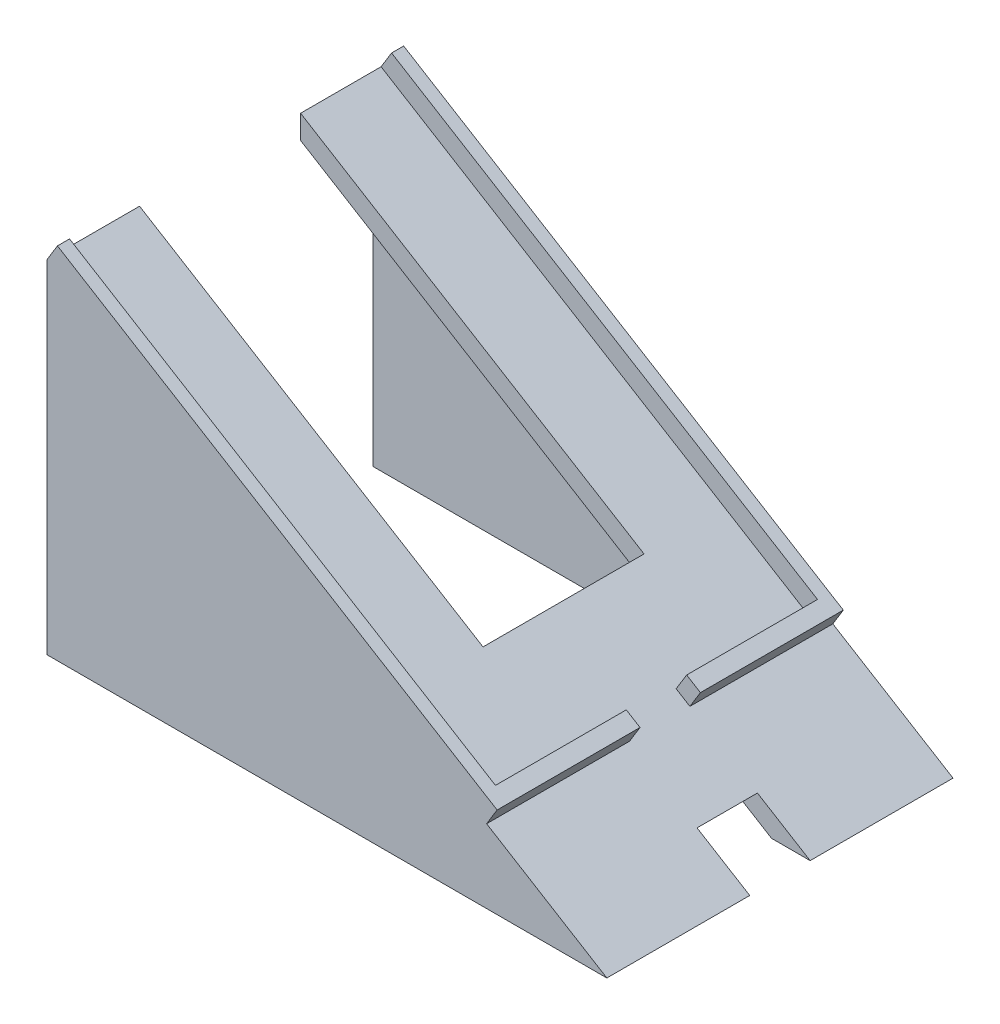
ISO-10303-21;
HEADER;
FILE_DESCRIPTION(('STEP AP214'),'2;1');
FILE_NAME('part.step','',(''),(''),'','','');
FILE_SCHEMA(('AUTOMOTIVE_DESIGN { 1 0 10303 214 1 1 1 1 }'));
ENDSEC;
DATA;
#1=APPLICATION_CONTEXT('core data for automotive mechanical design processes');
#2=APPLICATION_PROTOCOL_DEFINITION('international standard','automotive_design',2000,#1);
#3=PRODUCT_CONTEXT('',#1,'mechanical');
#4=PRODUCT('Part','Part','',(#3));
#5=PRODUCT_RELATED_PRODUCT_CATEGORY('part','',(#4));
#6=PRODUCT_DEFINITION_FORMATION('','',#4);
#7=PRODUCT_DEFINITION_CONTEXT('part definition',#1,'design');
#8=PRODUCT_DEFINITION('design','',#6,#7);
#9=PRODUCT_DEFINITION_SHAPE('','',#8);
#10=(LENGTH_UNIT() NAMED_UNIT(*) SI_UNIT(.MILLI.,.METRE.));
#11=(NAMED_UNIT(*) PLANE_ANGLE_UNIT() SI_UNIT($,.RADIAN.));
#12=(NAMED_UNIT(*) SI_UNIT($,.STERADIAN.) SOLID_ANGLE_UNIT());
#13=UNCERTAINTY_MEASURE_WITH_UNIT(LENGTH_MEASURE(1.E-05),#10,'distance_accuracy_value','');
#14=(GEOMETRIC_REPRESENTATION_CONTEXT(3) GLOBAL_UNCERTAINTY_ASSIGNED_CONTEXT((#13)) GLOBAL_UNIT_ASSIGNED_CONTEXT((#10,
#11,#12)) REPRESENTATION_CONTEXT('',''));
#15=CARTESIAN_POINT('',(0.,0.,0.));
#16=DIRECTION('',(0.,0.,1.));
#17=DIRECTION('',(1.,0.,0.));
#18=AXIS2_PLACEMENT_3D('',#15,#16,#17);
#19=CARTESIAN_POINT('',(108.412613138086,34.6037640860647,83.));
#20=DIRECTION('',(0.853268154636256,-0.521472392638037,0.));
#21=DIRECTION('',(0.521472392638037,0.853268154636256,0.));
#22=AXIS2_PLACEMENT_3D('',#19,#20,#21);
#23=PLANE('',#22);
#24=DIRECTION('',(0.,0.,1.));
#25=VECTOR('',#24,1.);
#26=CARTESIAN_POINT('',(108.412613138086,34.6037640860647,83.));
#27=LINE('',#26,#25);
#28=CARTESIAN_POINT('',(108.412613138086,34.6037640860647,50.5));
#29=VERTEX_POINT('',#28);
#30=CARTESIAN_POINT('',(108.412613138086,34.6037640860647,83.));
#31=VERTEX_POINT('',#30);
#32=EDGE_CURVE('E270',#29,#31,#27,.T.);
#33=ORIENTED_EDGE('',*,*,#32,.F.);
#34=DIRECTION('',(-0.521472392638037,-0.853268154636256,0.));
#35=VECTOR('',#34,1.);
#36=CARTESIAN_POINT('',(108.412613138086,34.6037640860647,50.5));
#37=LINE('',#36,#35);
#38=CARTESIAN_POINT('',(105.805251174896,30.3374233128835,50.5));
#39=VERTEX_POINT('',#38);
#40=EDGE_CURVE('E315',#29,#39,#37,.T.);
#41=ORIENTED_EDGE('',*,*,#40,.T.);
#42=DIRECTION('',(0.,0.,1.));
#43=VECTOR('',#42,1.);
#44=CARTESIAN_POINT('',(105.805251174896,30.3374233128834,83.));
#45=LINE('',#44,#43);
#46=CARTESIAN_POINT('',(105.805251174896,30.3374233128834,83.));
#47=VERTEX_POINT('',#46);
#48=EDGE_CURVE('E248',#39,#47,#45,.T.);
#49=ORIENTED_EDGE('',*,*,#48,.T.);
#50=DIRECTION('',(-0.521472392638037,-0.853268154636256,0.));
#51=VECTOR('',#50,1.);
#52=CARTESIAN_POINT('',(108.412613138086,34.6037640860647,83.));
#53=LINE('',#52,#51);
#54=EDGE_CURVE('E237',#31,#47,#53,.T.);
#55=ORIENTED_EDGE('',*,*,#54,.F.);
#56=EDGE_LOOP('',(#33,#41,#49,#55));
#57=FACE_BOUND('',#56,.T.);
#58=ADVANCED_FACE('F41',(#57),#23,.F.);
#59=CARTESIAN_POINT('',(111.825685756631,32.5178745155126,86.));
#60=DIRECTION('',(-0.853268154636256,0.521472392638037,0.));
#61=DIRECTION('',(-0.521472392638037,-0.853268154636256,0.));
#62=AXIS2_PLACEMENT_3D('',#59,#60,#61);
#63=PLANE('',#62);
#64=DIRECTION('',(0.,0.,-1.));
#65=VECTOR('',#64,1.);
#66=CARTESIAN_POINT('',(109.218323793441,28.2515337423313,86.));
#67=LINE('',#66,#65);
#68=CARTESIAN_POINT('',(109.218323793441,28.2515337423313,86.));
#69=VERTEX_POINT('',#68);
#70=CARTESIAN_POINT('',(109.218323793441,28.2515337423313,50.5));
#71=VERTEX_POINT('',#70);
#72=EDGE_CURVE('E231',#69,#71,#67,.T.);
#73=ORIENTED_EDGE('',*,*,#72,.T.);
#74=DIRECTION('',(-0.521472392638037,-0.853268154636256,0.));
#75=VECTOR('',#74,1.);
#76=CARTESIAN_POINT('',(111.825685756631,32.5178745155125,50.5));
#77=LINE('',#76,#75);
#78=CARTESIAN_POINT('',(111.825685756631,32.5178745155125,50.5));
#79=VERTEX_POINT('',#78);
#80=EDGE_CURVE('E216',#79,#71,#77,.T.);
#81=ORIENTED_EDGE('',*,*,#80,.F.);
#82=DIRECTION('',(0.,0.,-1.));
#83=VECTOR('',#82,1.);
#84=CARTESIAN_POINT('',(111.825685756631,32.5178745155126,86.));
#85=LINE('',#84,#83);
#86=CARTESIAN_POINT('',(111.825685756631,32.5178745155126,86.));
#87=VERTEX_POINT('',#86);
#88=EDGE_CURVE('E258',#87,#79,#85,.T.);
#89=ORIENTED_EDGE('',*,*,#88,.F.);
#90=DIRECTION('',(-0.521472392638037,-0.853268154636256,0.));
#91=VECTOR('',#90,1.);
#92=CARTESIAN_POINT('',(111.825685756631,32.5178745155126,86.));
#93=LINE('',#92,#91);
#94=EDGE_CURVE('E235',#87,#69,#93,.T.);
#95=ORIENTED_EDGE('',*,*,#94,.T.);
#96=EDGE_LOOP('',(#73,#81,#89,#95));
#97=FACE_BOUND('',#96,.T.);
#98=ADVANCED_FACE('F469',(#97),#63,.F.);
#99=CARTESIAN_POINT('',(44.8781616483912,73.4326624262356,0.));
#100=DIRECTION('',(-0.521472392638037,-0.853268154636256,0.));
#101=DIRECTION('',(0.853268154636256,-0.521472392638037,0.));
#102=AXIS2_PLACEMENT_3D('',#99,#100,#101);
#103=PLANE('',#102);
#104=ORIENTED_EDGE('',*,*,#88,.T.);
#105=DIRECTION('',(-0.853268154636256,0.521472392638037,0.));
#106=VECTOR('',#105,1.);
#107=CARTESIAN_POINT('',(44.8781616483912,73.4326624262356,50.5));
#108=LINE('',#107,#106);
#109=EDGE_CURVE('E11',#79,#29,#108,.T.);
#110=ORIENTED_EDGE('',*,*,#109,.T.);
#111=ORIENTED_EDGE('',*,*,#32,.T.);
#112=DIRECTION('',(-0.853268154636256,0.521472392638037,0.));
#113=VECTOR('',#112,1.);
#114=CARTESIAN_POINT('',(2.60736196319018,99.2663407731813,83.));
#115=LINE('',#114,#113);
#116=CARTESIAN_POINT('',(2.60736196319018,99.2663407731813,83.));
#117=VERTEX_POINT('',#116);
#118=EDGE_CURVE('E265',#31,#117,#115,.T.);
#119=ORIENTED_EDGE('',*,*,#118,.T.);
#120=DIRECTION('',(0.,0.,1.));
#121=VECTOR('',#120,1.);
#122=CARTESIAN_POINT('',(2.60736196319018,99.2663407731813,86.));
#123=LINE('',#122,#121);
#124=CARTESIAN_POINT('',(2.60736196319018,99.2663407731813,86.));
#125=VERTEX_POINT('',#124);
#126=EDGE_CURVE('E263',#117,#125,#123,.T.);
#127=ORIENTED_EDGE('',*,*,#126,.T.);
#128=DIRECTION('',(0.853268154636256,-0.521472392638037,0.));
#129=VECTOR('',#128,1.);
#130=CARTESIAN_POINT('',(111.825685756631,32.5178745155126,86.));
#131=LINE('',#130,#129);
#132=EDGE_CURVE('E261',#125,#87,#131,.T.);
#133=ORIENTED_EDGE('',*,*,#132,.T.);
#134=EDGE_LOOP('',(#104,#110,#111,#119,#127,#133));
#135=FACE_BOUND('',#134,.T.);
#136=ADVANCED_FACE('F471',(#135),#103,.F.);
#137=CARTESIAN_POINT('',(0.,10.,86.));
#138=DIRECTION('',(0.,1.,0.));
#139=DIRECTION('',(0.,0.,1.));
#140=AXIS2_PLACEMENT_3D('',#137,#138,#139);
#141=PLANE('',#140);
#142=DIRECTION('',(0.,0.,-1.));
#143=VECTOR('',#142,1.);
#144=CARTESIAN_POINT('',(139.08270920571,10.,86.));
#145=LINE('',#144,#143);
#146=CARTESIAN_POINT('',(139.08270920571,10.,35.5));
#147=VERTEX_POINT('',#146);
#148=CARTESIAN_POINT('',(139.08270920571,10.,0.));
#149=VERTEX_POINT('',#148);
#150=EDGE_CURVE('E363',#147,#149,#145,.T.);
#151=ORIENTED_EDGE('',*,*,#150,.F.);
#152=DIRECTION('',(-1.,0.,0.));
#153=VECTOR('',#152,1.);
#154=CARTESIAN_POINT('',(139.08270920571,10.,35.5));
#155=LINE('',#154,#153);
#156=CARTESIAN_POINT('',(129.494473911592,10.,35.5));
#157=VERTEX_POINT('',#156);
#158=EDGE_CURVE('E322',#147,#157,#155,.T.);
#159=ORIENTED_EDGE('',*,*,#158,.T.);
#160=DIRECTION('',(0.,0.,-1.));
#161=VECTOR('',#160,1.);
#162=CARTESIAN_POINT('',(129.494473911592,10.,86.));
#163=LINE('',#162,#161);
#164=CARTESIAN_POINT('',(129.494473911592,10.,5.));
#165=VERTEX_POINT('',#164);
#166=EDGE_CURVE('E349',#157,#165,#163,.T.);
#167=ORIENTED_EDGE('',*,*,#166,.T.);
#168=DIRECTION('',(-1.,0.,0.));
#169=VECTOR('',#168,1.);
#170=CARTESIAN_POINT('',(0.,10.,5.));
#171=LINE('',#170,#169);
#172=CARTESIAN_POINT('',(0.,10.,5.));
#173=VERTEX_POINT('',#172);
#174=EDGE_CURVE('E295',#165,#173,#171,.T.);
#175=ORIENTED_EDGE('',*,*,#174,.T.);
#176=DIRECTION('',(0.,0.,1.));
#177=VECTOR('',#176,1.);
#178=CARTESIAN_POINT('',(0.,10.,86.));
#179=LINE('',#178,#177);
#180=CARTESIAN_POINT('',(0.,10.,0.));
#181=VERTEX_POINT('',#180);
#182=EDGE_CURVE('E342',#181,#173,#179,.T.);
#183=ORIENTED_EDGE('',*,*,#182,.F.);
#184=DIRECTION('',(1.,0.,0.));
#185=VECTOR('',#184,1.);
#186=CARTESIAN_POINT('',(0.,10.,0.));
#187=LINE('',#186,#185);
#188=EDGE_CURVE('E345',#181,#149,#187,.T.);
#189=ORIENTED_EDGE('',*,*,#188,.T.);
#190=EDGE_LOOP('',(#151,#159,#167,#175,#183,#189));
#191=FACE_BOUND('',#190,.T.);
#192=ADVANCED_FACE('F473',(#191),#141,.F.);
#193=CARTESIAN_POINT('',(0.,0.,86.));
#194=DIRECTION('',(-1.,0.,0.));
#195=DIRECTION('',(0.,0.,1.));
#196=AXIS2_PLACEMENT_3D('',#193,#194,#195);
#197=PLANE('',#196);
#198=ORIENTED_EDGE('',*,*,#182,.T.);
#199=DIRECTION('',(0.,1.,0.));
#200=VECTOR('',#199,1.);
#201=CARTESIAN_POINT('',(0.,0.,5.));
#202=LINE('',#201,#200);
#203=CARTESIAN_POINT('',(0.,89.1401774192177,5.));
#204=VERTEX_POINT('',#203);
#205=EDGE_CURVE('E301',#173,#204,#202,.T.);
#206=ORIENTED_EDGE('',*,*,#205,.T.);
#207=DIRECTION('',(0.,0.,-1.));
#208=VECTOR('',#207,1.);
#209=CARTESIAN_POINT('',(0.,89.1401774192177,86.));
#210=LINE('',#209,#208);
#211=CARTESIAN_POINT('',(0.,89.1401774192177,23.));
#212=VERTEX_POINT('',#211);
#213=EDGE_CURVE('E360',#212,#204,#210,.T.);
#214=ORIENTED_EDGE('',*,*,#213,.F.);
#215=DIRECTION('',(0.,-1.,0.));
#216=VECTOR('',#215,1.);
#217=CARTESIAN_POINT('',(0.,0.,23.));
#218=LINE('',#217,#216);
#219=CARTESIAN_POINT('',(0.,95.,23.));
#220=VERTEX_POINT('',#219);
#221=EDGE_CURVE('E278',#220,#212,#218,.T.);
#222=ORIENTED_EDGE('',*,*,#221,.F.);
#223=DIRECTION('',(0.,0.,-1.));
#224=VECTOR('',#223,1.);
#225=CARTESIAN_POINT('',(0.,95.,86.));
#226=LINE('',#225,#224);
#227=CARTESIAN_POINT('',(0.,95.,3.));
#228=VERTEX_POINT('',#227);
#229=EDGE_CURVE('E303',#220,#228,#226,.T.);
#230=ORIENTED_EDGE('',*,*,#229,.T.);
#231=DIRECTION('',(0.,0.,1.));
#232=VECTOR('',#231,1.);
#233=CARTESIAN_POINT('',(0.,95.,3.));
#234=LINE('',#233,#232);
#235=CARTESIAN_POINT('',(0.,95.,0.));
#236=VERTEX_POINT('',#235);
#237=EDGE_CURVE('E252',#236,#228,#234,.T.);
#238=ORIENTED_EDGE('',*,*,#237,.F.);
#239=DIRECTION('',(0.,1.,0.));
#240=VECTOR('',#239,1.);
#241=CARTESIAN_POINT('',(0.,0.,0.));
#242=LINE('',#241,#240);
#243=EDGE_CURVE('E371',#181,#236,#242,.T.);
#244=ORIENTED_EDGE('',*,*,#243,.F.);
#245=EDGE_LOOP('',(#198,#206,#214,#222,#230,#238,#244));
#246=FACE_BOUND('',#245,.T.);
#247=ADVANCED_FACE('F479',(#246),#197,.T.);
#248=CARTESIAN_POINT('',(42.270799685201,69.1663216530543,86.));
#249=DIRECTION('',(0.521472392638037,0.853268154636256,0.));
#250=DIRECTION('',(-0.853268154636256,0.521472392638037,0.));
#251=AXIS2_PLACEMENT_3D('',#248,#249,#250);
#252=PLANE('',#251);
#253=ORIENTED_EDGE('',*,*,#48,.F.);
#254=DIRECTION('',(0.853268154636256,-0.521472392638037,0.));
#255=VECTOR('',#254,1.);
#256=CARTESIAN_POINT('',(100.685642247078,33.4662576687116,50.5));
#257=LINE('',#256,#255);
#258=EDGE_CURVE('E215',#39,#71,#257,.T.);
#259=ORIENTED_EDGE('',*,*,#258,.T.);
#260=ORIENTED_EDGE('',*,*,#72,.F.);
#261=DIRECTION('',(0.853268154636256,-0.521472392638037,0.));
#262=VECTOR('',#261,1.);
#263=CARTESIAN_POINT('',(42.270799685201,69.1663216530543,86.));
#264=LINE('',#263,#262);
#265=CARTESIAN_POINT('',(139.08270920571,10.,86.));
#266=VERTEX_POINT('',#265);
#267=EDGE_CURVE('E374',#69,#266,#264,.T.);
#268=ORIENTED_EDGE('',*,*,#267,.T.);
#269=CARTESIAN_POINT('',(139.08270920571,10.,50.5));
#270=VERTEX_POINT('',#269);
#271=EDGE_CURVE('E300',#266,#270,#145,.T.);
#272=ORIENTED_EDGE('',*,*,#271,.T.);
#273=DIRECTION('',(0.853268154636256,-0.521472392638037,0.));
#274=VECTOR('',#273,1.);
#275=CARTESIAN_POINT('',(42.270799685201,69.1663216530543,50.5));
#276=LINE('',#275,#274);
#277=CARTESIAN_POINT('',(125.992571868702,18.,50.5));
#278=VERTEX_POINT('',#277);
#279=EDGE_CURVE('E64',#278,#270,#276,.T.);
#280=ORIENTED_EDGE('',*,*,#279,.F.);
#281=DIRECTION('',(0.,0.,1.));
#282=VECTOR('',#281,1.);
#283=CARTESIAN_POINT('',(125.992571868702,18.,86.));
#284=LINE('',#283,#282);
#285=CARTESIAN_POINT('',(125.992571868702,18.,35.5));
#286=VERTEX_POINT('',#285);
#287=EDGE_CURVE('E339',#286,#278,#284,.T.);
#288=ORIENTED_EDGE('',*,*,#287,.F.);
#289=DIRECTION('',(-0.853268154636256,0.521472392638037,0.));
#290=VECTOR('',#289,1.);
#291=CARTESIAN_POINT('',(42.270799685201,69.1663216530543,35.5));
#292=LINE('',#291,#290);
#293=EDGE_CURVE('E337',#147,#286,#292,.T.);
#294=ORIENTED_EDGE('',*,*,#293,.F.);
#295=ORIENTED_EDGE('',*,*,#150,.T.);
#296=DIRECTION('',(0.853268154636256,-0.521472392638037,0.));
#297=VECTOR('',#296,1.);
#298=CARTESIAN_POINT('',(42.270799685201,69.1663216530543,0.));
#299=LINE('',#298,#297);
#300=CARTESIAN_POINT('',(109.218323793441,28.2515337423313,0.));
#301=VERTEX_POINT('',#300);
#302=EDGE_CURVE('E230',#301,#149,#299,.T.);
#303=ORIENTED_EDGE('',*,*,#302,.F.);
#304=CARTESIAN_POINT('',(109.218323793441,28.2515337423313,35.5));
#305=VERTEX_POINT('',#304);
#306=EDGE_CURVE('E222',#305,#301,#67,.T.);
#307=ORIENTED_EDGE('',*,*,#306,.F.);
#308=DIRECTION('',(0.853268154636256,-0.521472392638037,0.));
#309=VECTOR('',#308,1.);
#310=CARTESIAN_POINT('',(100.685642247078,33.4662576687116,35.5));
#311=LINE('',#310,#309);
#312=CARTESIAN_POINT('',(105.805251174896,30.3374233128835,35.5));
#313=VERTEX_POINT('',#312);
#314=EDGE_CURVE('E207',#313,#305,#311,.T.);
#315=ORIENTED_EDGE('',*,*,#314,.F.);
#316=CARTESIAN_POINT('',(105.805251174896,30.3374233128834,3.));
#317=VERTEX_POINT('',#316);
#318=EDGE_CURVE('E246',#317,#313,#45,.T.);
#319=ORIENTED_EDGE('',*,*,#318,.F.);
#320=DIRECTION('',(0.853268154636256,-0.521472392638037,0.));
#321=VECTOR('',#320,1.);
#322=CARTESIAN_POINT('',(105.805251174896,30.3374233128834,3.));
#323=LINE('',#322,#321);
#324=EDGE_CURVE('E249',#228,#317,#323,.T.);
#325=ORIENTED_EDGE('',*,*,#324,.F.);
#326=ORIENTED_EDGE('',*,*,#229,.F.);
#327=DIRECTION('',(-0.853268154636256,0.521472392638037,0.));
#328=VECTOR('',#327,1.);
#329=CARTESIAN_POINT('',(0.,95.,23.));
#330=LINE('',#329,#328);
#331=CARTESIAN_POINT('',(85.3268154636256,42.8527607361963,23.));
#332=VERTEX_POINT('',#331);
#333=EDGE_CURVE('E281',#332,#220,#330,.T.);
#334=ORIENTED_EDGE('',*,*,#333,.F.);
#335=DIRECTION('',(0.,0.,-1.));
#336=VECTOR('',#335,1.);
#337=CARTESIAN_POINT('',(85.3268154636256,42.8527607361963,23.));
#338=LINE('',#337,#336);
#339=CARTESIAN_POINT('',(85.3268154636256,42.8527607361963,63.));
#340=VERTEX_POINT('',#339);
#341=EDGE_CURVE('E287',#340,#332,#338,.T.);
#342=ORIENTED_EDGE('',*,*,#341,.F.);
#343=DIRECTION('',(0.853268154636256,-0.521472392638037,0.));
#344=VECTOR('',#343,1.);
#345=CARTESIAN_POINT('',(85.3268154636256,42.8527607361963,63.));
#346=LINE('',#345,#344);
#347=CARTESIAN_POINT('',(0.,95.,63.));
#348=VERTEX_POINT('',#347);
#349=EDGE_CURVE('E289',#348,#340,#346,.T.);
#350=ORIENTED_EDGE('',*,*,#349,.F.);
#351=CARTESIAN_POINT('',(0.,95.,83.));
#352=VERTEX_POINT('',#351);
#353=EDGE_CURVE('E367',#352,#348,#226,.T.);
#354=ORIENTED_EDGE('',*,*,#353,.F.);
#355=DIRECTION('',(-0.853268154636256,0.521472392638037,0.));
#356=VECTOR('',#355,1.);
#357=CARTESIAN_POINT('',(0.,95.,83.));
#358=LINE('',#357,#356);
#359=EDGE_CURVE('E243',#47,#352,#358,.T.);
#360=ORIENTED_EDGE('',*,*,#359,.F.);
#361=EDGE_LOOP('',(#253,#259,#260,#268,#272,#280,#288,#294,#295,#303,#307,#315,#319,#325,#326,
#334,#342,#350,#354,#360));
#362=FACE_BOUND('',#361,.T.);
#363=ADVANCED_FACE('F228',(#362),#252,.T.);
#364=CARTESIAN_POINT('',(39.6634377220108,64.8999808798731,86.));
#365=DIRECTION('',(-0.521472392638036,-0.853268154636256,0.));
#366=DIRECTION('',(0.853268154636256,-0.521472392638036,0.));
#367=AXIS2_PLACEMENT_3D('',#364,#365,#366);
#368=PLANE('',#367);
#369=DIRECTION('',(0.853268154636256,-0.521472392638036,0.));
#370=VECTOR('',#369,1.);
#371=CARTESIAN_POINT('',(39.6634377220108,64.8999808798731,35.5));
#372=LINE('',#371,#370);
#373=CARTESIAN_POINT('',(116.404336574584,18.,35.5));
#374=VERTEX_POINT('',#373);
#375=EDGE_CURVE('E335',#374,#157,#372,.T.);
#376=ORIENTED_EDGE('',*,*,#375,.F.);
#377=DIRECTION('',(0.,0.,-1.));
#378=VECTOR('',#377,1.);
#379=CARTESIAN_POINT('',(116.404336574584,18.,86.));
#380=LINE('',#379,#378);
#381=CARTESIAN_POINT('',(116.404336574584,18.,50.5));
#382=VERTEX_POINT('',#381);
#383=EDGE_CURVE('E308',#382,#374,#380,.T.);
#384=ORIENTED_EDGE('',*,*,#383,.F.);
#385=DIRECTION('',(-0.853268154636256,0.521472392638036,0.));
#386=VECTOR('',#385,1.);
#387=CARTESIAN_POINT('',(39.6634377220108,64.8999808798731,50.5));
#388=LINE('',#387,#386);
#389=CARTESIAN_POINT('',(129.494473911592,10.,50.5));
#390=VERTEX_POINT('',#389);
#391=EDGE_CURVE('E325',#390,#382,#388,.T.);
#392=ORIENTED_EDGE('',*,*,#391,.F.);
#393=CARTESIAN_POINT('',(129.494473911592,10.,81.));
#394=VERTEX_POINT('',#393);
#395=EDGE_CURVE('E352',#394,#390,#163,.T.);
#396=ORIENTED_EDGE('',*,*,#395,.F.);
#397=DIRECTION('',(-0.853268154636256,0.521472392638037,0.));
#398=VECTOR('',#397,1.);
#399=CARTESIAN_POINT('',(0.,89.1401774192177,81.));
#400=LINE('',#399,#398);
#401=CARTESIAN_POINT('',(0.,89.1401774192177,81.));
#402=VERTEX_POINT('',#401);
#403=EDGE_CURVE('E299',#394,#402,#400,.T.);
#404=ORIENTED_EDGE('',*,*,#403,.T.);
#405=CARTESIAN_POINT('',(0.,89.1401774192177,63.));
#406=VERTEX_POINT('',#405);
#407=EDGE_CURVE('E357',#402,#406,#210,.T.);
#408=ORIENTED_EDGE('',*,*,#407,.T.);
#409=DIRECTION('',(-0.853268154636256,0.521472392638036,0.));
#410=VECTOR('',#409,1.);
#411=CARTESIAN_POINT('',(39.6634377220108,64.8999808798731,63.));
#412=LINE('',#411,#410);
#413=CARTESIAN_POINT('',(82.7194535004354,38.5864199630151,63.));
#414=VERTEX_POINT('',#413);
#415=EDGE_CURVE('E284',#414,#406,#412,.T.);
#416=ORIENTED_EDGE('',*,*,#415,.F.);
#417=DIRECTION('',(0.,0.,1.));
#418=VECTOR('',#417,1.);
#419=CARTESIAN_POINT('',(82.7194535004354,38.5864199630152,86.));
#420=LINE('',#419,#418);
#421=CARTESIAN_POINT('',(82.7194535004354,38.5864199630151,23.));
#422=VERTEX_POINT('',#421);
#423=EDGE_CURVE('E280',#422,#414,#420,.T.);
#424=ORIENTED_EDGE('',*,*,#423,.F.);
#425=DIRECTION('',(0.853268154636256,-0.521472392638036,0.));
#426=VECTOR('',#425,1.);
#427=CARTESIAN_POINT('',(39.6634377220108,64.8999808798731,23.));
#428=LINE('',#427,#426);
#429=EDGE_CURVE('E257',#212,#422,#428,.T.);
#430=ORIENTED_EDGE('',*,*,#429,.F.);
#431=ORIENTED_EDGE('',*,*,#213,.T.);
#432=DIRECTION('',(0.853268154636256,-0.521472392638037,0.));
#433=VECTOR('',#432,1.);
#434=CARTESIAN_POINT('',(0.,89.1401774192177,5.));
#435=LINE('',#434,#433);
#436=EDGE_CURVE('E296',#204,#165,#435,.T.);
#437=ORIENTED_EDGE('',*,*,#436,.T.);
#438=ORIENTED_EDGE('',*,*,#166,.F.);
#439=EDGE_LOOP('',(#376,#384,#392,#396,#404,#408,#416,#424,#430,#431,#437,#438));
#440=FACE_BOUND('',#439,.T.);
#441=ADVANCED_FACE('F426',(#440),#368,.T.);
#442=CARTESIAN_POINT('',(0.,10.,81.));
#443=VERTEX_POINT('',#442);
#444=CARTESIAN_POINT('',(0.,10.,86.));
#445=VERTEX_POINT('',#444);
#446=EDGE_CURVE('E341',#443,#445,#179,.T.);
#447=ORIENTED_EDGE('',*,*,#446,.T.);
#448=DIRECTION('',(0.,1.,0.));
#449=VECTOR('',#448,1.);
#450=CARTESIAN_POINT('',(0.,0.,86.));
#451=LINE('',#450,#449);
#452=CARTESIAN_POINT('',(0.,95.,86.));
#453=VERTEX_POINT('',#452);
#454=EDGE_CURVE('E368',#445,#453,#451,.T.);
#455=ORIENTED_EDGE('',*,*,#454,.T.);
#456=EDGE_CURVE('E364',#453,#352,#226,.T.);
#457=ORIENTED_EDGE('',*,*,#456,.T.);
#458=ORIENTED_EDGE('',*,*,#353,.T.);
#459=DIRECTION('',(0.,1.,0.));
#460=VECTOR('',#459,1.);
#461=CARTESIAN_POINT('',(0.,0.,63.));
#462=LINE('',#461,#460);
#463=EDGE_CURVE('E286',#406,#348,#462,.T.);
#464=ORIENTED_EDGE('',*,*,#463,.F.);
#465=ORIENTED_EDGE('',*,*,#407,.F.);
#466=DIRECTION('',(0.,-1.,0.));
#467=VECTOR('',#466,1.);
#468=CARTESIAN_POINT('',(0.,5.,81.));
#469=LINE('',#468,#467);
#470=EDGE_CURVE('E379',#402,#443,#469,.T.);
#471=ORIENTED_EDGE('',*,*,#470,.T.);
#472=EDGE_LOOP('',(#447,#455,#457,#458,#464,#465,#471));
#473=FACE_BOUND('',#472,.T.);
#474=ADVANCED_FACE('F414',(#473),#197,.T.);
#475=CARTESIAN_POINT('',(0.,0.,86.));
#476=DIRECTION('',(0.,0.,1.));
#477=DIRECTION('',(1.,0.,0.));
#478=AXIS2_PLACEMENT_3D('',#475,#476,#477);
#479=PLANE('',#478);
#480=DIRECTION('',(1.,0.,0.));
#481=VECTOR('',#480,1.);
#482=CARTESIAN_POINT('',(0.,10.,86.));
#483=LINE('',#482,#481);
#484=EDGE_CURVE('E346',#445,#266,#483,.T.);
#485=ORIENTED_EDGE('',*,*,#484,.T.);
#486=ORIENTED_EDGE('',*,*,#267,.F.);
#487=ORIENTED_EDGE('',*,*,#94,.F.);
#488=ORIENTED_EDGE('',*,*,#132,.F.);
#489=DIRECTION('',(-0.521472392638037,-0.853268154636256,0.));
#490=VECTOR('',#489,1.);
#491=CARTESIAN_POINT('',(2.60736196319018,99.2663407731813,86.));
#492=LINE('',#491,#490);
#493=EDGE_CURVE('E373',#125,#453,#492,.T.);
#494=ORIENTED_EDGE('',*,*,#493,.T.);
#495=ORIENTED_EDGE('',*,*,#454,.F.);
#496=EDGE_LOOP('',(#485,#486,#487,#488,#494,#495));
#497=FACE_BOUND('',#496,.T.);
#498=ADVANCED_FACE('F448',(#497),#479,.T.);
#499=CARTESIAN_POINT('',(0.,0.,0.));
#500=DIRECTION('',(0.,0.,1.));
#501=DIRECTION('',(1.,0.,0.));
#502=AXIS2_PLACEMENT_3D('',#499,#500,#501);
#503=PLANE('',#502);
#504=ORIENTED_EDGE('',*,*,#302,.T.);
#505=ORIENTED_EDGE('',*,*,#188,.F.);
#506=ORIENTED_EDGE('',*,*,#243,.T.);
#507=DIRECTION('',(-0.521472392638037,-0.853268154636256,0.));
#508=VECTOR('',#507,1.);
#509=CARTESIAN_POINT('',(2.60736196319018,99.2663407731813,0.));
#510=LINE('',#509,#508);
#511=CARTESIAN_POINT('',(2.60736196319018,99.2663407731813,0.));
#512=VERTEX_POINT('',#511);
#513=EDGE_CURVE('E241',#512,#236,#510,.T.);
#514=ORIENTED_EDGE('',*,*,#513,.F.);
#515=DIRECTION('',(-0.853268154636256,0.521472392638037,0.));
#516=VECTOR('',#515,1.);
#517=CARTESIAN_POINT('',(2.60736196319018,99.2663407731813,0.));
#518=LINE('',#517,#516);
#519=CARTESIAN_POINT('',(111.825685756631,32.5178745155126,0.));
#520=VERTEX_POINT('',#519);
#521=EDGE_CURVE('E255',#520,#512,#518,.T.);
#522=ORIENTED_EDGE('',*,*,#521,.F.);
#523=DIRECTION('',(-0.521472392638037,-0.853268154636256,0.));
#524=VECTOR('',#523,1.);
#525=CARTESIAN_POINT('',(111.825685756631,32.5178745155126,0.));
#526=LINE('',#525,#524);
#527=EDGE_CURVE('E370',#520,#301,#526,.T.);
#528=ORIENTED_EDGE('',*,*,#527,.T.);
#529=EDGE_LOOP('',(#504,#505,#506,#514,#522,#528));
#530=FACE_BOUND('',#529,.T.);
#531=ADVANCED_FACE('F391',(#530),#503,.F.);
#532=CARTESIAN_POINT('',(0.,0.,81.));
#533=DIRECTION('',(0.,0.,1.));
#534=DIRECTION('',(1.,0.,0.));
#535=AXIS2_PLACEMENT_3D('',#532,#533,#534);
#536=PLANE('',#535);
#537=ORIENTED_EDGE('',*,*,#403,.F.);
#538=DIRECTION('',(-1.,0.,0.));
#539=VECTOR('',#538,1.);
#540=CARTESIAN_POINT('',(0.,10.,81.));
#541=LINE('',#540,#539);
#542=EDGE_CURVE('E304',#394,#443,#541,.T.);
#543=ORIENTED_EDGE('',*,*,#542,.T.);
#544=ORIENTED_EDGE('',*,*,#470,.F.);
#545=EDGE_LOOP('',(#537,#543,#544));
#546=FACE_BOUND('',#545,.T.);
#547=ADVANCED_FACE('F433',(#546),#536,.F.);
#548=CARTESIAN_POINT('',(2.60736196319018,99.2663407731813,3.));
#549=DIRECTION('',(0.853268154636256,-0.521472392638037,0.));
#550=DIRECTION('',(0.521472392638037,0.853268154636256,0.));
#551=AXIS2_PLACEMENT_3D('',#548,#549,#550);
#552=PLANE('',#551);
#553=ORIENTED_EDGE('',*,*,#237,.T.);
#554=DIRECTION('',(-0.521472392638037,-0.853268154636256,0.));
#555=VECTOR('',#554,1.);
#556=CARTESIAN_POINT('',(2.60736196319018,99.2663407731813,3.));
#557=LINE('',#556,#555);
#558=CARTESIAN_POINT('',(2.60736196319018,99.2663407731813,3.));
#559=VERTEX_POINT('',#558);
#560=EDGE_CURVE('E251',#559,#228,#557,.T.);
#561=ORIENTED_EDGE('',*,*,#560,.F.);
#562=DIRECTION('',(0.,0.,1.));
#563=VECTOR('',#562,1.);
#564=CARTESIAN_POINT('',(2.60736196319018,99.2663407731813,3.));
#565=LINE('',#564,#563);
#566=EDGE_CURVE('E273',#512,#559,#565,.T.);
#567=ORIENTED_EDGE('',*,*,#566,.F.);
#568=ORIENTED_EDGE('',*,*,#513,.T.);
#569=EDGE_LOOP('',(#553,#561,#567,#568));
#570=FACE_BOUND('',#569,.T.);
#571=ADVANCED_FACE('F399',(#570),#552,.F.);
#572=CARTESIAN_POINT('',(108.412613138086,34.6037640860647,3.));
#573=DIRECTION('',(0.,0.,-1.));
#574=DIRECTION('',(-1.,0.,0.));
#575=AXIS2_PLACEMENT_3D('',#572,#573,#574);
#576=PLANE('',#575);
#577=ORIENTED_EDGE('',*,*,#324,.T.);
#578=DIRECTION('',(-0.521472392638037,-0.853268154636256,0.));
#579=VECTOR('',#578,1.);
#580=CARTESIAN_POINT('',(108.412613138086,34.6037640860647,3.));
#581=LINE('',#580,#579);
#582=CARTESIAN_POINT('',(108.412613138086,34.6037640860647,3.));
#583=VERTEX_POINT('',#582);
#584=EDGE_CURVE('E245',#583,#317,#581,.T.);
#585=ORIENTED_EDGE('',*,*,#584,.F.);
#586=DIRECTION('',(0.853268154636256,-0.521472392638037,0.));
#587=VECTOR('',#586,1.);
#588=CARTESIAN_POINT('',(108.412613138086,34.6037640860647,3.));
#589=LINE('',#588,#587);
#590=EDGE_CURVE('E271',#559,#583,#589,.T.);
#591=ORIENTED_EDGE('',*,*,#590,.F.);
#592=ORIENTED_EDGE('',*,*,#560,.T.);
#593=EDGE_LOOP('',(#577,#585,#591,#592));
#594=FACE_BOUND('',#593,.T.);
#595=ADVANCED_FACE('F403',(#594),#576,.F.);
#596=ORIENTED_EDGE('',*,*,#318,.T.);
#597=DIRECTION('',(0.521472392638037,0.853268154636256,0.));
#598=VECTOR('',#597,1.);
#599=CARTESIAN_POINT('',(108.412613138086,34.6037640860647,35.5));
#600=LINE('',#599,#598);
#601=CARTESIAN_POINT('',(108.412613138086,34.6037640860647,35.5));
#602=VERTEX_POINT('',#601);
#603=EDGE_CURVE('E210',#313,#602,#600,.T.);
#604=ORIENTED_EDGE('',*,*,#603,.T.);
#605=EDGE_CURVE('E267',#583,#602,#27,.T.);
#606=ORIENTED_EDGE('',*,*,#605,.F.);
#607=ORIENTED_EDGE('',*,*,#584,.T.);
#608=EDGE_LOOP('',(#596,#604,#606,#607));
#609=FACE_BOUND('',#608,.T.);
#610=ADVANCED_FACE('F313',(#609),#23,.F.);
#611=CARTESIAN_POINT('',(2.60736196319018,99.2663407731813,83.));
#612=DIRECTION('',(0.,0.,1.));
#613=DIRECTION('',(1.,0.,0.));
#614=AXIS2_PLACEMENT_3D('',#611,#612,#613);
#615=PLANE('',#614);
#616=ORIENTED_EDGE('',*,*,#359,.T.);
#617=DIRECTION('',(-0.521472392638037,-0.853268154636256,0.));
#618=VECTOR('',#617,1.);
#619=CARTESIAN_POINT('',(2.60736196319018,99.2663407731813,83.));
#620=LINE('',#619,#618);
#621=EDGE_CURVE('E232',#117,#352,#620,.T.);
#622=ORIENTED_EDGE('',*,*,#621,.F.);
#623=ORIENTED_EDGE('',*,*,#118,.F.);
#624=ORIENTED_EDGE('',*,*,#54,.T.);
#625=EDGE_LOOP('',(#616,#622,#623,#624));
#626=FACE_BOUND('',#625,.T.);
#627=ADVANCED_FACE('F458',(#626),#615,.F.);
#628=CARTESIAN_POINT('',(2.60736196319018,99.2663407731813,86.));
#629=DIRECTION('',(0.853268154636256,-0.521472392638037,0.));
#630=DIRECTION('',(0.521472392638037,0.853268154636256,0.));
#631=AXIS2_PLACEMENT_3D('',#628,#629,#630);
#632=PLANE('',#631);
#633=ORIENTED_EDGE('',*,*,#456,.F.);
#634=ORIENTED_EDGE('',*,*,#493,.F.);
#635=ORIENTED_EDGE('',*,*,#126,.F.);
#636=ORIENTED_EDGE('',*,*,#621,.T.);
#637=EDGE_LOOP('',(#633,#634,#635,#636));
#638=FACE_BOUND('',#637,.T.);
#639=ADVANCED_FACE('F453',(#638),#632,.F.);
#640=CARTESIAN_POINT('',(111.825685756631,32.5178745155126,35.5));
#641=VERTEX_POINT('',#640);
#642=EDGE_CURVE('E224',#641,#520,#85,.T.);
#643=ORIENTED_EDGE('',*,*,#642,.F.);
#644=DIRECTION('',(0.521472392638037,0.853268154636256,0.));
#645=VECTOR('',#644,1.);
#646=CARTESIAN_POINT('',(109.218323793441,28.2515337423313,35.5));
#647=LINE('',#646,#645);
#648=EDGE_CURVE('E56',#305,#641,#647,.T.);
#649=ORIENTED_EDGE('',*,*,#648,.F.);
#650=ORIENTED_EDGE('',*,*,#306,.T.);
#651=ORIENTED_EDGE('',*,*,#527,.F.);
#652=EDGE_LOOP('',(#643,#649,#650,#651));
#653=FACE_BOUND('',#652,.T.);
#654=ADVANCED_FACE('F220',(#653),#63,.F.);
#655=ORIENTED_EDGE('',*,*,#605,.T.);
#656=DIRECTION('',(0.853268154636256,-0.521472392638037,0.));
#657=VECTOR('',#656,1.);
#658=CARTESIAN_POINT('',(44.8781616483912,73.4326624262356,35.5));
#659=LINE('',#658,#657);
#660=EDGE_CURVE('E49',#602,#641,#659,.T.);
#661=ORIENTED_EDGE('',*,*,#660,.T.);
#662=ORIENTED_EDGE('',*,*,#642,.T.);
#663=ORIENTED_EDGE('',*,*,#521,.T.);
#664=ORIENTED_EDGE('',*,*,#566,.T.);
#665=ORIENTED_EDGE('',*,*,#590,.T.);
#666=EDGE_LOOP('',(#655,#661,#662,#663,#664,#665));
#667=FACE_BOUND('',#666,.T.);
#668=ADVANCED_FACE('F310',(#667),#103,.F.);
#669=CARTESIAN_POINT('',(-42.270799685201,25.8336783469457,23.));
#670=DIRECTION('',(0.,0.,-1.));
#671=DIRECTION('',(-1.,0.,0.));
#672=AXIS2_PLACEMENT_3D('',#669,#670,#671);
#673=PLANE('',#672);
#674=ORIENTED_EDGE('',*,*,#429,.T.);
#675=DIRECTION('',(0.521472392638037,0.853268154636256,0.));
#676=VECTOR('',#675,1.);
#677=CARTESIAN_POINT('',(43.0560157784246,-26.313560916858,23.));
#678=LINE('',#677,#676);
#679=EDGE_CURVE('E277',#422,#332,#678,.T.);
#680=ORIENTED_EDGE('',*,*,#679,.T.);
#681=ORIENTED_EDGE('',*,*,#333,.T.);
#682=ORIENTED_EDGE('',*,*,#221,.T.);
#683=EDGE_LOOP('',(#674,#680,#681,#682));
#684=FACE_BOUND('',#683,.T.);
#685=ADVANCED_FACE('F485',(#684),#673,.F.);
#686=CARTESIAN_POINT('',(43.0560157784246,-26.313560916858,23.));
#687=DIRECTION('',(0.853268154636256,-0.521472392638037,0.));
#688=DIRECTION('',(0.521472392638037,0.853268154636256,0.));
#689=AXIS2_PLACEMENT_3D('',#686,#687,#688);
#690=PLANE('',#689);
#691=ORIENTED_EDGE('',*,*,#423,.T.);
#692=DIRECTION('',(0.521472392638037,0.853268154636256,0.));
#693=VECTOR('',#692,1.);
#694=CARTESIAN_POINT('',(43.0560157784246,-26.313560916858,63.));
#695=LINE('',#694,#693);
#696=EDGE_CURVE('E283',#414,#340,#695,.T.);
#697=ORIENTED_EDGE('',*,*,#696,.T.);
#698=ORIENTED_EDGE('',*,*,#341,.T.);
#699=ORIENTED_EDGE('',*,*,#679,.F.);
#700=EDGE_LOOP('',(#691,#697,#698,#699));
#701=FACE_BOUND('',#700,.T.);
#702=ADVANCED_FACE('F43',(#701),#690,.F.);
#703=CARTESIAN_POINT('',(43.0560157784246,-26.313560916858,63.));
#704=DIRECTION('',(0.,0.,1.));
#705=DIRECTION('',(1.,0.,0.));
#706=AXIS2_PLACEMENT_3D('',#703,#704,#705);
#707=PLANE('',#706);
#708=ORIENTED_EDGE('',*,*,#415,.T.);
#709=ORIENTED_EDGE('',*,*,#463,.T.);
#710=ORIENTED_EDGE('',*,*,#349,.T.);
#711=ORIENTED_EDGE('',*,*,#696,.F.);
#712=EDGE_LOOP('',(#708,#709,#710,#711));
#713=FACE_BOUND('',#712,.T.);
#714=ADVANCED_FACE('F421',(#713),#707,.F.);
#715=CARTESIAN_POINT('',(0.,0.,5.));
#716=DIRECTION('',(0.,0.,1.));
#717=DIRECTION('',(1.,0.,0.));
#718=AXIS2_PLACEMENT_3D('',#715,#716,#717);
#719=PLANE('',#718);
#720=ORIENTED_EDGE('',*,*,#174,.F.);
#721=ORIENTED_EDGE('',*,*,#436,.F.);
#722=ORIENTED_EDGE('',*,*,#205,.F.);
#723=EDGE_LOOP('',(#720,#721,#722));
#724=FACE_BOUND('',#723,.T.);
#725=ADVANCED_FACE('F516',(#724),#719,.T.);
#726=ORIENTED_EDGE('',*,*,#395,.T.);
#727=DIRECTION('',(-1.,0.,0.));
#728=VECTOR('',#727,1.);
#729=CARTESIAN_POINT('',(139.08270920571,10.,50.5));
#730=LINE('',#729,#728);
#731=EDGE_CURVE('E318',#270,#390,#730,.T.);
#732=ORIENTED_EDGE('',*,*,#731,.F.);
#733=ORIENTED_EDGE('',*,*,#271,.F.);
#734=ORIENTED_EDGE('',*,*,#484,.F.);
#735=ORIENTED_EDGE('',*,*,#446,.F.);
#736=ORIENTED_EDGE('',*,*,#542,.F.);
#737=EDGE_LOOP('',(#726,#732,#733,#734,#735,#736));
#738=FACE_BOUND('',#737,.T.);
#739=ADVANCED_FACE('F435',(#738),#141,.F.);
#740=CARTESIAN_POINT('',(139.08270920571,18.,35.5));
#741=DIRECTION('',(0.,0.,-1.));
#742=DIRECTION('',(-1.,0.,0.));
#743=AXIS2_PLACEMENT_3D('',#740,#741,#742);
#744=PLANE('',#743);
#745=ORIENTED_EDGE('',*,*,#293,.T.);
#746=DIRECTION('',(-1.,0.,0.));
#747=VECTOR('',#746,1.);
#748=CARTESIAN_POINT('',(139.08270920571,18.,35.5));
#749=LINE('',#748,#747);
#750=EDGE_CURVE('E326',#286,#374,#749,.T.);
#751=ORIENTED_EDGE('',*,*,#750,.T.);
#752=ORIENTED_EDGE('',*,*,#375,.T.);
#753=ORIENTED_EDGE('',*,*,#158,.F.);
#754=EDGE_LOOP('',(#745,#751,#752,#753));
#755=FACE_BOUND('',#754,.T.);
#756=ADVANCED_FACE('F515',(#755),#744,.F.);
#757=CARTESIAN_POINT('',(139.08270920571,18.,50.5));
#758=DIRECTION('',(0.,1.,0.));
#759=DIRECTION('',(0.,0.,1.));
#760=AXIS2_PLACEMENT_3D('',#757,#758,#759);
#761=PLANE('',#760);
#762=ORIENTED_EDGE('',*,*,#287,.T.);
#763=DIRECTION('',(-1.,0.,0.));
#764=VECTOR('',#763,1.);
#765=CARTESIAN_POINT('',(139.08270920571,18.,50.5));
#766=LINE('',#765,#764);
#767=EDGE_CURVE('E329',#278,#382,#766,.T.);
#768=ORIENTED_EDGE('',*,*,#767,.T.);
#769=ORIENTED_EDGE('',*,*,#383,.T.);
#770=ORIENTED_EDGE('',*,*,#750,.F.);
#771=EDGE_LOOP('',(#762,#768,#769,#770));
#772=FACE_BOUND('',#771,.T.);
#773=ADVANCED_FACE('F440',(#772),#761,.F.);
#774=CARTESIAN_POINT('',(139.08270920571,10.,50.5));
#775=DIRECTION('',(0.,0.,1.));
#776=DIRECTION('',(1.,0.,0.));
#777=AXIS2_PLACEMENT_3D('',#774,#775,#776);
#778=PLANE('',#777);
#779=ORIENTED_EDGE('',*,*,#279,.T.);
#780=ORIENTED_EDGE('',*,*,#731,.T.);
#781=ORIENTED_EDGE('',*,*,#391,.T.);
#782=ORIENTED_EDGE('',*,*,#767,.F.);
#783=EDGE_LOOP('',(#779,#780,#781,#782));
#784=FACE_BOUND('',#783,.T.);
#785=ADVANCED_FACE('F438',(#784),#778,.F.);
#786=CARTESIAN_POINT('',(103.293004210268,37.7325984418929,50.5));
#787=DIRECTION('',(0.,0.,1.));
#788=DIRECTION('',(1.,0.,0.));
#789=AXIS2_PLACEMENT_3D('',#786,#787,#788);
#790=PLANE('',#789);
#791=ORIENTED_EDGE('',*,*,#109,.F.);
#792=ORIENTED_EDGE('',*,*,#80,.T.);
#793=ORIENTED_EDGE('',*,*,#258,.F.);
#794=ORIENTED_EDGE('',*,*,#40,.F.);
#795=EDGE_LOOP('',(#791,#792,#793,#794));
#796=FACE_BOUND('',#795,.T.);
#797=ADVANCED_FACE('F465',(#796),#790,.F.);
#798=CARTESIAN_POINT('',(100.685642247078,33.4662576687116,35.5));
#799=DIRECTION('',(0.,0.,-1.));
#800=DIRECTION('',(-1.,0.,0.));
#801=AXIS2_PLACEMENT_3D('',#798,#799,#800);
#802=PLANE('',#801);
#803=ORIENTED_EDGE('',*,*,#314,.T.);
#804=ORIENTED_EDGE('',*,*,#648,.T.);
#805=ORIENTED_EDGE('',*,*,#660,.F.);
#806=ORIENTED_EDGE('',*,*,#603,.F.);
#807=EDGE_LOOP('',(#803,#804,#805,#806));
#808=FACE_BOUND('',#807,.T.);
#809=ADVANCED_FACE('F208',(#808),#802,.F.);
#810=CLOSED_SHELL('',(#58,#98,#136,#192,#247,#363,#441,#474,#498,#531,#547,#571,#595,#610,#627,
#639,#654,#668,#685,#702,#714,#725,#739,#756,#773,#785,#797,#809));
#811=MANIFOLD_SOLID_BREP('B2',#810);
#812=ADVANCED_BREP_SHAPE_REPRESENTATION('',(#18,#811),#14);
#813=SHAPE_DEFINITION_REPRESENTATION(#9,#812);
ENDSEC;
END-ISO-10303-21;
